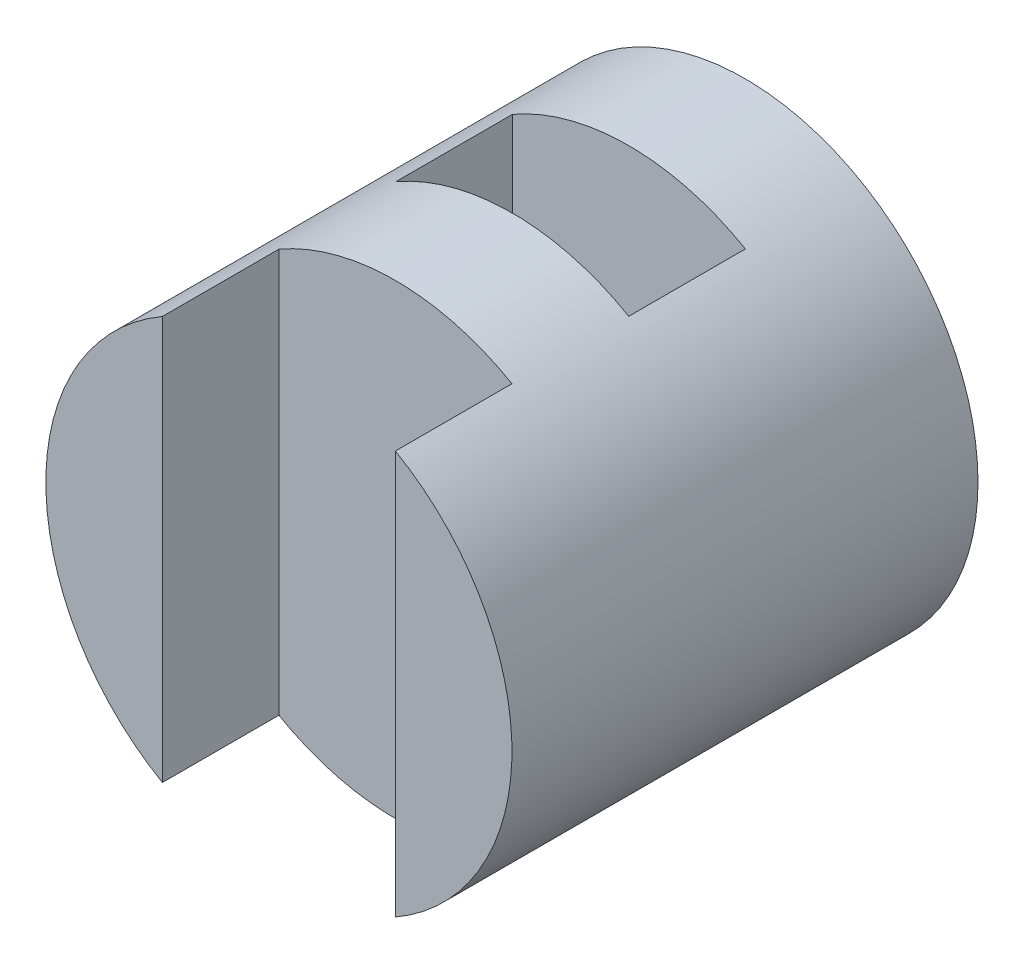
ISO-10303-21;
HEADER;
FILE_DESCRIPTION(('STEP AP214'),'2;1');
FILE_NAME('part.step','',(''),(''),'','','');
FILE_SCHEMA(('AUTOMOTIVE_DESIGN { 1 0 10303 214 1 1 1 1 }'));
ENDSEC;
DATA;
#1=APPLICATION_CONTEXT('core data for automotive mechanical design processes');
#2=APPLICATION_PROTOCOL_DEFINITION('international standard','automotive_design',2000,#1);
#3=PRODUCT_CONTEXT('',#1,'mechanical');
#4=PRODUCT('Part','Part','',(#3));
#5=PRODUCT_RELATED_PRODUCT_CATEGORY('part','',(#4));
#6=PRODUCT_DEFINITION_FORMATION('','',#4);
#7=PRODUCT_DEFINITION_CONTEXT('part definition',#1,'design');
#8=PRODUCT_DEFINITION('design','',#6,#7);
#9=PRODUCT_DEFINITION_SHAPE('','',#8);
#10=(LENGTH_UNIT() NAMED_UNIT(*) SI_UNIT(.MILLI.,.METRE.));
#11=(NAMED_UNIT(*) PLANE_ANGLE_UNIT() SI_UNIT($,.RADIAN.));
#12=(NAMED_UNIT(*) SI_UNIT($,.STERADIAN.) SOLID_ANGLE_UNIT());
#13=UNCERTAINTY_MEASURE_WITH_UNIT(LENGTH_MEASURE(1.E-05),#10,'distance_accuracy_value','');
#14=(GEOMETRIC_REPRESENTATION_CONTEXT(3) GLOBAL_UNCERTAINTY_ASSIGNED_CONTEXT((#13)) GLOBAL_UNIT_ASSIGNED_CONTEXT((#10,
#11,#12)) REPRESENTATION_CONTEXT('',''));
#15=CARTESIAN_POINT('',(0.,0.,0.));
#16=DIRECTION('',(0.,0.,1.));
#17=DIRECTION('',(1.,0.,0.));
#18=AXIS2_PLACEMENT_3D('',#15,#16,#17);
#19=CARTESIAN_POINT('',(0.,0.,4.));
#20=DIRECTION('',(0.,0.,1.));
#21=DIRECTION('',(1.,0.,0.));
#22=AXIS2_PLACEMENT_3D('',#19,#20,#21);
#23=PLANE('',#22);
#24=DIRECTION('',(0.,-1.,0.));
#25=VECTOR('',#24,1.);
#26=CARTESIAN_POINT('',(-1.,0.,4.));
#27=LINE('',#26,#25);
#28=CARTESIAN_POINT('',(-1.,1.73205080756888,4.));
#29=VERTEX_POINT('',#28);
#30=CARTESIAN_POINT('',(-1.,-1.73205080756888,4.));
#31=VERTEX_POINT('',#30);
#32=EDGE_CURVE('E107',#29,#31,#27,.T.);
#33=ORIENTED_EDGE('',*,*,#32,.F.);
#34=CARTESIAN_POINT('',(0.,0.,4.));
#35=DIRECTION('',(0.,0.,1.));
#36=DIRECTION('',(1.,0.,0.));
#37=AXIS2_PLACEMENT_3D('',#34,#35,#36);
#38=CIRCLE('',#37,2.);
#39=EDGE_CURVE('E108',#29,#31,#38,.T.);
#40=ORIENTED_EDGE('',*,*,#39,.T.);
#41=EDGE_LOOP('',(#33,#40));
#42=FACE_BOUND('',#41,.T.);
#43=ADVANCED_FACE('F33',(#42),#23,.T.);
#44=CARTESIAN_POINT('',(0.,0.,4.));
#45=DIRECTION('',(0.,0.,-1.));
#46=DIRECTION('',(-1.,0.,0.));
#47=AXIS2_PLACEMENT_3D('',#44,#45,#46);
#48=CYLINDRICAL_SURFACE('',#47,2.);
#49=CARTESIAN_POINT('',(0.,0.,1.9973095496113));
#50=DIRECTION('',(0.,0.,1.));
#51=DIRECTION('',(1.,0.,0.));
#52=AXIS2_PLACEMENT_3D('',#49,#50,#51);
#53=CIRCLE('',#52,2.);
#54=CARTESIAN_POINT('',(1.,1.73205080756888,1.9973095496113));
#55=VERTEX_POINT('',#54);
#56=CARTESIAN_POINT('',(-1.,1.73205080756888,1.9973095496113));
#57=VERTEX_POINT('',#56);
#58=EDGE_CURVE('E136',#55,#57,#53,.T.);
#59=ORIENTED_EDGE('',*,*,#58,.T.);
#60=DIRECTION('',(0.,0.,-1.));
#61=VECTOR('',#60,1.);
#62=CARTESIAN_POINT('',(-1.,1.73205080756888,4.));
#63=LINE('',#62,#61);
#64=CARTESIAN_POINT('',(-1.,1.73205080756888,0.996426666909849));
#65=VERTEX_POINT('',#64);
#66=EDGE_CURVE('E11',#57,#65,#63,.T.);
#67=ORIENTED_EDGE('',*,*,#66,.T.);
#68=CARTESIAN_POINT('',(0.,0.,0.996426666909849));
#69=DIRECTION('',(0.,0.,-1.));
#70=DIRECTION('',(-1.,0.,0.));
#71=AXIS2_PLACEMENT_3D('',#68,#69,#70);
#72=CIRCLE('',#71,2.);
#73=CARTESIAN_POINT('',(1.,1.73205080756888,0.996426666909849));
#74=VERTEX_POINT('',#73);
#75=EDGE_CURVE('E41',#65,#74,#72,.T.);
#76=ORIENTED_EDGE('',*,*,#75,.T.);
#77=DIRECTION('',(0.,0.,-1.));
#78=VECTOR('',#77,1.);
#79=CARTESIAN_POINT('',(1.,1.73205080756888,4.));
#80=LINE('',#79,#78);
#81=EDGE_CURVE('E144',#74,#55,#80,.F.);
#82=ORIENTED_EDGE('',*,*,#81,.T.);
#83=EDGE_LOOP('',(#59,#67,#76,#82));
#84=FACE_BOUND('',#83,.T.);
#85=CARTESIAN_POINT('',(1.,-1.73205080756888,0.996426666909849));
#86=VERTEX_POINT('',#85);
#87=CARTESIAN_POINT('',(-1.,-1.73205080756888,0.996426666909849));
#88=VERTEX_POINT('',#87);
#89=EDGE_CURVE('E139',#86,#88,#72,.T.);
#90=ORIENTED_EDGE('',*,*,#89,.T.);
#91=DIRECTION('',(0.,0.,-1.));
#92=VECTOR('',#91,1.);
#93=CARTESIAN_POINT('',(-1.,-1.73205080756888,4.));
#94=LINE('',#93,#92);
#95=CARTESIAN_POINT('',(-1.,-1.73205080756888,1.9973095496113));
#96=VERTEX_POINT('',#95);
#97=EDGE_CURVE('E142',#88,#96,#94,.F.);
#98=ORIENTED_EDGE('',*,*,#97,.T.);
#99=CARTESIAN_POINT('',(1.,-1.73205080756888,1.9973095496113));
#100=VERTEX_POINT('',#99);
#101=EDGE_CURVE('E132',#96,#100,#53,.T.);
#102=ORIENTED_EDGE('',*,*,#101,.T.);
#103=DIRECTION('',(0.,0.,-1.));
#104=VECTOR('',#103,1.);
#105=CARTESIAN_POINT('',(1.,-1.73205080756888,4.));
#106=LINE('',#105,#104);
#107=EDGE_CURVE('E135',#100,#86,#106,.T.);
#108=ORIENTED_EDGE('',*,*,#107,.T.);
#109=EDGE_LOOP('',(#90,#98,#102,#108));
#110=FACE_BOUND('',#109,.T.);
#111=CARTESIAN_POINT('',(0.,0.,3.));
#112=DIRECTION('',(0.,0.,-1.));
#113=DIRECTION('',(-1.,0.,0.));
#114=AXIS2_PLACEMENT_3D('',#111,#112,#113);
#115=CIRCLE('',#114,2.);
#116=CARTESIAN_POINT('',(1.,-1.73205080756888,3.));
#117=VERTEX_POINT('',#116);
#118=CARTESIAN_POINT('',(-1.,-1.73205080756888,3.));
#119=VERTEX_POINT('',#118);
#120=EDGE_CURVE('E131',#117,#119,#115,.T.);
#121=ORIENTED_EDGE('',*,*,#120,.T.);
#122=DIRECTION('',(0.,0.,-1.));
#123=VECTOR('',#122,1.);
#124=CARTESIAN_POINT('',(-1.,-1.73205080756888,4.));
#125=LINE('',#124,#123);
#126=EDGE_CURVE('E166',#119,#31,#125,.F.);
#127=ORIENTED_EDGE('',*,*,#126,.T.);
#128=ORIENTED_EDGE('',*,*,#39,.F.);
#129=DIRECTION('',(0.,0.,-1.));
#130=VECTOR('',#129,1.);
#131=CARTESIAN_POINT('',(-1.,1.73205080756888,4.));
#132=LINE('',#131,#130);
#133=CARTESIAN_POINT('',(-1.,1.73205080756888,3.));
#134=VERTEX_POINT('',#133);
#135=EDGE_CURVE('E124',#29,#134,#132,.T.);
#136=ORIENTED_EDGE('',*,*,#135,.T.);
#137=CARTESIAN_POINT('',(1.,1.73205080756888,3.));
#138=VERTEX_POINT('',#137);
#139=EDGE_CURVE('E116',#134,#138,#115,.T.);
#140=ORIENTED_EDGE('',*,*,#139,.T.);
#141=DIRECTION('',(0.,0.,-1.));
#142=VECTOR('',#141,1.);
#143=CARTESIAN_POINT('',(1.,1.73205080756888,4.));
#144=LINE('',#143,#142);
#145=CARTESIAN_POINT('',(1.,1.73205080756888,4.));
#146=VERTEX_POINT('',#145);
#147=EDGE_CURVE('E100',#138,#146,#144,.F.);
#148=ORIENTED_EDGE('',*,*,#147,.T.);
#149=CARTESIAN_POINT('',(1.,-1.73205080756888,4.));
#150=VERTEX_POINT('',#149);
#151=EDGE_CURVE('E114',#150,#146,#38,.T.);
#152=ORIENTED_EDGE('',*,*,#151,.F.);
#153=DIRECTION('',(0.,0.,-1.));
#154=VECTOR('',#153,1.);
#155=CARTESIAN_POINT('',(1.,-1.73205080756888,4.));
#156=LINE('',#155,#154);
#157=EDGE_CURVE('E103',#150,#117,#156,.T.);
#158=ORIENTED_EDGE('',*,*,#157,.T.);
#159=EDGE_LOOP('',(#121,#127,#128,#136,#140,#148,#152,#158));
#160=FACE_BOUND('',#159,.T.);
#161=CARTESIAN_POINT('',(0.,0.,0.));
#162=DIRECTION('',(0.,0.,1.));
#163=DIRECTION('',(1.,0.,0.));
#164=AXIS2_PLACEMENT_3D('',#161,#162,#163);
#165=CIRCLE('',#164,2.);
#166=CARTESIAN_POINT('',(2.,0.,0.));
#167=VERTEX_POINT('',#166);
#168=EDGE_CURVE('E120',#167,#167,#165,.T.);
#169=ORIENTED_EDGE('',*,*,#168,.T.);
#170=EDGE_LOOP('',(#169));
#171=FACE_BOUND('',#170,.T.);
#172=ADVANCED_FACE('F35',(#84,#110,#160,#171),#48,.T.);
#173=DIRECTION('',(0.,1.,0.));
#174=VECTOR('',#173,1.);
#175=CARTESIAN_POINT('',(1.,0.,4.));
#176=LINE('',#175,#174);
#177=EDGE_CURVE('E96',#150,#146,#176,.T.);
#178=ORIENTED_EDGE('',*,*,#177,.F.);
#179=ORIENTED_EDGE('',*,*,#151,.T.);
#180=EDGE_LOOP('',(#178,#179));
#181=FACE_BOUND('',#180,.T.);
#182=ADVANCED_FACE('F119',(#181),#23,.T.);
#183=CARTESIAN_POINT('',(0.,0.,0.));
#184=DIRECTION('',(0.,0.,1.));
#185=DIRECTION('',(1.,0.,0.));
#186=AXIS2_PLACEMENT_3D('',#183,#184,#185);
#187=PLANE('',#186);
#188=ORIENTED_EDGE('',*,*,#168,.F.);
#189=EDGE_LOOP('',(#188));
#190=FACE_BOUND('',#189,.T.);
#191=ADVANCED_FACE('F182',(#190),#187,.F.);
#192=CARTESIAN_POINT('',(-1.,-5.,3.));
#193=DIRECTION('',(0.,0.,-1.));
#194=DIRECTION('',(-1.,0.,0.));
#195=AXIS2_PLACEMENT_3D('',#192,#193,#194);
#196=PLANE('',#195);
#197=DIRECTION('',(0.,1.,0.));
#198=VECTOR('',#197,1.);
#199=CARTESIAN_POINT('',(-1.,-5.,3.));
#200=LINE('',#199,#198);
#201=EDGE_CURVE('E158',#119,#134,#200,.T.);
#202=ORIENTED_EDGE('',*,*,#201,.F.);
#203=ORIENTED_EDGE('',*,*,#120,.F.);
#204=DIRECTION('',(0.,1.,0.));
#205=VECTOR('',#204,1.);
#206=CARTESIAN_POINT('',(1.,-5.,3.));
#207=LINE('',#206,#205);
#208=EDGE_CURVE('E164',#117,#138,#207,.T.);
#209=ORIENTED_EDGE('',*,*,#208,.T.);
#210=ORIENTED_EDGE('',*,*,#139,.F.);
#211=EDGE_LOOP('',(#202,#203,#209,#210));
#212=FACE_BOUND('',#211,.T.);
#213=ADVANCED_FACE('F187',(#212),#196,.F.);
#214=CARTESIAN_POINT('',(-1.,-5.,4.));
#215=DIRECTION('',(-1.,0.,0.));
#216=DIRECTION('',(0.,0.,1.));
#217=AXIS2_PLACEMENT_3D('',#214,#215,#216);
#218=PLANE('',#217);
#219=ORIENTED_EDGE('',*,*,#32,.T.);
#220=ORIENTED_EDGE('',*,*,#126,.F.);
#221=ORIENTED_EDGE('',*,*,#201,.T.);
#222=ORIENTED_EDGE('',*,*,#135,.F.);
#223=EDGE_LOOP('',(#219,#220,#221,#222));
#224=FACE_BOUND('',#223,.T.);
#225=ADVANCED_FACE('F171',(#224),#218,.F.);
#226=CARTESIAN_POINT('',(1.,-5.,4.));
#227=DIRECTION('',(1.,0.,0.));
#228=DIRECTION('',(0.,0.,-1.));
#229=AXIS2_PLACEMENT_3D('',#226,#227,#228);
#230=PLANE('',#229);
#231=ORIENTED_EDGE('',*,*,#177,.T.);
#232=ORIENTED_EDGE('',*,*,#147,.F.);
#233=ORIENTED_EDGE('',*,*,#208,.F.);
#234=ORIENTED_EDGE('',*,*,#157,.F.);
#235=EDGE_LOOP('',(#231,#232,#233,#234));
#236=FACE_BOUND('',#235,.T.);
#237=ADVANCED_FACE('F98',(#236),#230,.F.);
#238=CARTESIAN_POINT('',(-1.,-5.,1.9973095496113));
#239=DIRECTION('',(-1.,0.,0.));
#240=DIRECTION('',(0.,0.,1.));
#241=AXIS2_PLACEMENT_3D('',#238,#239,#240);
#242=PLANE('',#241);
#243=DIRECTION('',(0.,1.,0.));
#244=VECTOR('',#243,1.);
#245=CARTESIAN_POINT('',(-1.,-5.,1.9973095496113));
#246=LINE('',#245,#244);
#247=EDGE_CURVE('E48',#96,#57,#246,.T.);
#248=ORIENTED_EDGE('',*,*,#247,.F.);
#249=ORIENTED_EDGE('',*,*,#97,.F.);
#250=DIRECTION('',(0.,1.,0.));
#251=VECTOR('',#250,1.);
#252=CARTESIAN_POINT('',(-1.,-5.,0.996426666909849));
#253=LINE('',#252,#251);
#254=EDGE_CURVE('E117',#88,#65,#253,.T.);
#255=ORIENTED_EDGE('',*,*,#254,.T.);
#256=ORIENTED_EDGE('',*,*,#66,.F.);
#257=EDGE_LOOP('',(#248,#249,#255,#256));
#258=FACE_BOUND('',#257,.T.);
#259=ADVANCED_FACE('F199',(#258),#242,.F.);
#260=CARTESIAN_POINT('',(-1.,-5.,0.996426666909849));
#261=DIRECTION('',(0.,0.,-1.));
#262=DIRECTION('',(-1.,0.,0.));
#263=AXIS2_PLACEMENT_3D('',#260,#261,#262);
#264=PLANE('',#263);
#265=ORIENTED_EDGE('',*,*,#254,.F.);
#266=ORIENTED_EDGE('',*,*,#89,.F.);
#267=DIRECTION('',(0.,1.,0.));
#268=VECTOR('',#267,1.);
#269=CARTESIAN_POINT('',(1.,-5.,0.996426666909849));
#270=LINE('',#269,#268);
#271=EDGE_CURVE('E155',#86,#74,#270,.T.);
#272=ORIENTED_EDGE('',*,*,#271,.T.);
#273=ORIENTED_EDGE('',*,*,#75,.F.);
#274=EDGE_LOOP('',(#265,#266,#272,#273));
#275=FACE_BOUND('',#274,.T.);
#276=ADVANCED_FACE('F205',(#275),#264,.F.);
#277=CARTESIAN_POINT('',(1.,-5.,1.9973095496113));
#278=DIRECTION('',(1.,0.,0.));
#279=DIRECTION('',(0.,0.,-1.));
#280=AXIS2_PLACEMENT_3D('',#277,#278,#279);
#281=PLANE('',#280);
#282=DIRECTION('',(0.,1.,0.));
#283=VECTOR('',#282,1.);
#284=CARTESIAN_POINT('',(1.,-5.,1.9973095496113));
#285=LINE('',#284,#283);
#286=EDGE_CURVE('E53',#100,#55,#285,.T.);
#287=ORIENTED_EDGE('',*,*,#286,.T.);
#288=ORIENTED_EDGE('',*,*,#81,.F.);
#289=ORIENTED_EDGE('',*,*,#271,.F.);
#290=ORIENTED_EDGE('',*,*,#107,.F.);
#291=EDGE_LOOP('',(#287,#288,#289,#290));
#292=FACE_BOUND('',#291,.T.);
#293=ADVANCED_FACE('F152',(#292),#281,.F.);
#294=CARTESIAN_POINT('',(-1.,-5.,1.9973095496113));
#295=DIRECTION('',(0.,0.,1.));
#296=DIRECTION('',(1.,0.,0.));
#297=AXIS2_PLACEMENT_3D('',#294,#295,#296);
#298=PLANE('',#297);
#299=ORIENTED_EDGE('',*,*,#286,.F.);
#300=ORIENTED_EDGE('',*,*,#101,.F.);
#301=ORIENTED_EDGE('',*,*,#247,.T.);
#302=ORIENTED_EDGE('',*,*,#58,.F.);
#303=EDGE_LOOP('',(#299,#300,#301,#302));
#304=FACE_BOUND('',#303,.T.);
#305=ADVANCED_FACE('F150',(#304),#298,.F.);
#306=CLOSED_SHELL('',(#43,#172,#182,#191,#213,#225,#237,#259,#276,#293,#305));
#307=MANIFOLD_SOLID_BREP('B2',#306);
#308=ADVANCED_BREP_SHAPE_REPRESENTATION('',(#18,#307),#14);
#309=SHAPE_DEFINITION_REPRESENTATION(#9,#308);
ENDSEC;
END-ISO-10303-21;
